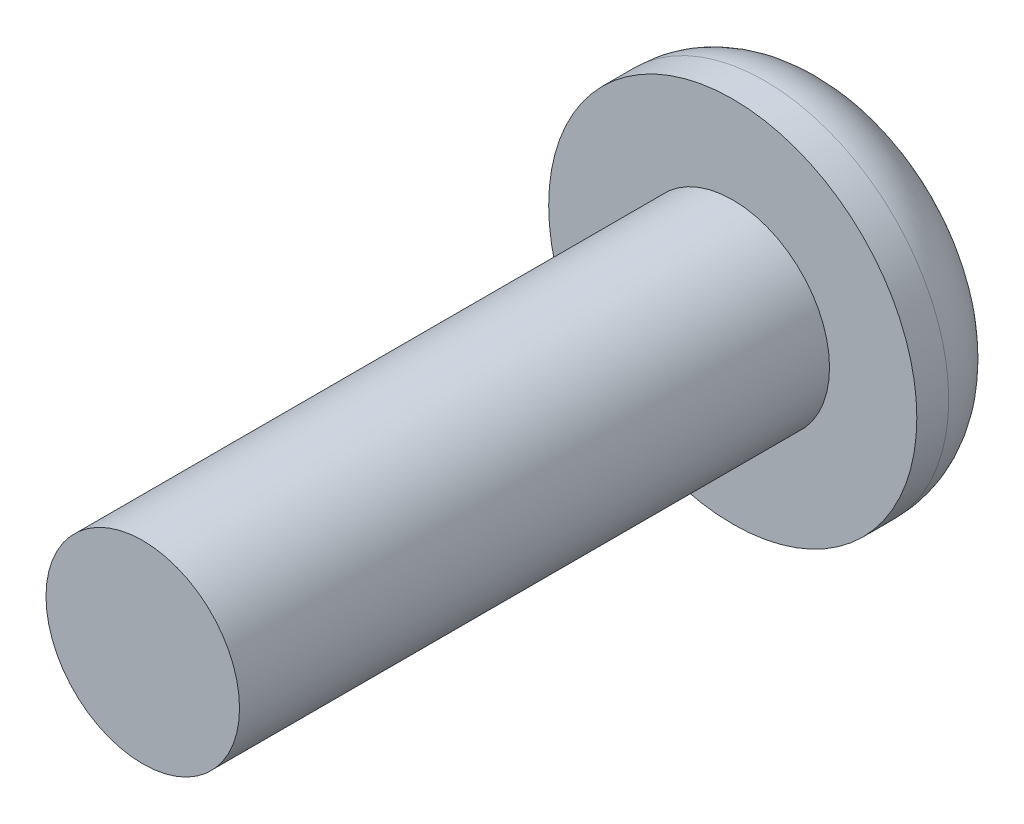
ISO-10303-21;
HEADER;
FILE_DESCRIPTION(('STEP AP214'),'2;1');
FILE_NAME('part.step','',(''),(''),'','','');
FILE_SCHEMA(('AUTOMOTIVE_DESIGN { 1 0 10303 214 1 1 1 1 }'));
ENDSEC;
DATA;
#1=APPLICATION_CONTEXT('core data for automotive mechanical design processes');
#2=APPLICATION_PROTOCOL_DEFINITION('international standard','automotive_design',2000,#1);
#3=PRODUCT_CONTEXT('',#1,'mechanical');
#4=PRODUCT('Part','Part','',(#3));
#5=PRODUCT_RELATED_PRODUCT_CATEGORY('part','',(#4));
#6=PRODUCT_DEFINITION_FORMATION('','',#4);
#7=PRODUCT_DEFINITION_CONTEXT('part definition',#1,'design');
#8=PRODUCT_DEFINITION('design','',#6,#7);
#9=PRODUCT_DEFINITION_SHAPE('','',#8);
#10=(LENGTH_UNIT() NAMED_UNIT(*) SI_UNIT(.MILLI.,.METRE.));
#11=(NAMED_UNIT(*) PLANE_ANGLE_UNIT() SI_UNIT($,.RADIAN.));
#12=(NAMED_UNIT(*) SI_UNIT($,.STERADIAN.) SOLID_ANGLE_UNIT());
#13=UNCERTAINTY_MEASURE_WITH_UNIT(LENGTH_MEASURE(1.E-05),#10,'distance_accuracy_value','');
#14=(GEOMETRIC_REPRESENTATION_CONTEXT(3) GLOBAL_UNCERTAINTY_ASSIGNED_CONTEXT((#13)) GLOBAL_UNIT_ASSIGNED_CONTEXT((#10,
#11,#12)) REPRESENTATION_CONTEXT('',''));
#15=CARTESIAN_POINT('',(0.,0.,0.));
#16=DIRECTION('',(0.,0.,1.));
#17=DIRECTION('',(1.,0.,0.));
#18=AXIS2_PLACEMENT_3D('',#15,#16,#17);
#19=CARTESIAN_POINT('',(0.,0.,2.2098));
#20=DIRECTION('',(0.,0.,1.));
#21=DIRECTION('',(1.,0.,0.));
#22=AXIS2_PLACEMENT_3D('',#19,#20,#21);
#23=PLANE('',#22);
#24=CARTESIAN_POINT('',(0.,0.,2.2098));
#25=DIRECTION('',(0.,0.,1.));
#26=DIRECTION('',(1.,0.,0.));
#27=AXIS2_PLACEMENT_3D('',#24,#25,#26);
#28=CIRCLE('',#27,3.9624);
#29=CARTESIAN_POINT('',(3.9624,0.,2.2098));
#30=VERTEX_POINT('',#29);
#31=EDGE_CURVE('E142',#30,#30,#28,.T.);
#32=ORIENTED_EDGE('',*,*,#31,.T.);
#33=EDGE_LOOP('',(#32));
#34=FACE_BOUND('',#33,.T.);
#35=CARTESIAN_POINT('',(0.,0.,2.2098));
#36=DIRECTION('',(0.,0.,1.));
#37=DIRECTION('',(1.,0.,0.));
#38=AXIS2_PLACEMENT_3D('',#35,#36,#37);
#39=CIRCLE('',#38,2.0828);
#40=CARTESIAN_POINT('',(2.0828,0.,2.2098));
#41=VERTEX_POINT('',#40);
#42=EDGE_CURVE('E133',#41,#41,#39,.T.);
#43=ORIENTED_EDGE('',*,*,#42,.F.);
#44=EDGE_LOOP('',(#43));
#45=FACE_BOUND('',#44,.T.);
#46=ADVANCED_FACE('F31',(#34,#45),#23,.T.);
#47=CARTESIAN_POINT('',(0.,0.,2.2098));
#48=DIRECTION('',(0.,0.,-1.));
#49=DIRECTION('',(-1.,0.,0.));
#50=AXIS2_PLACEMENT_3D('',#47,#48,#49);
#51=CYLINDRICAL_SURFACE('',#50,3.9624);
#52=CARTESIAN_POINT('',(0.,0.,1.524));
#53=DIRECTION('',(0.,0.,1.));
#54=DIRECTION('',(1.,0.,0.));
#55=AXIS2_PLACEMENT_3D('',#52,#53,#54);
#56=CIRCLE('',#55,3.9624);
#57=CARTESIAN_POINT('',(3.9624,0.,1.524));
#58=VERTEX_POINT('',#57);
#59=EDGE_CURVE('E39',#58,#58,#56,.T.);
#60=ORIENTED_EDGE('',*,*,#59,.T.);
#61=EDGE_LOOP('',(#60));
#62=FACE_BOUND('',#61,.T.);
#63=ORIENTED_EDGE('',*,*,#31,.F.);
#64=EDGE_LOOP('',(#63));
#65=FACE_BOUND('',#64,.T.);
#66=ADVANCED_FACE('F149',(#62,#65),#51,.T.);
#67=CARTESIAN_POINT('',(0.,0.,0.));
#68=DIRECTION('',(0.,0.,1.));
#69=DIRECTION('',(1.,0.,0.));
#70=AXIS2_PLACEMENT_3D('',#67,#68,#69);
#71=PLANE('',#70);
#72=DIRECTION('',(0.999833415798117,0.0182521410653723,0.));
#73=VECTOR('',#72,1.);
#74=CARTESIAN_POINT('',(-0.709024608452739,1.17787999902725,0.));
#75=LINE('',#74,#73);
#76=CARTESIAN_POINT('',(-0.709024608452739,1.17787999902725,0.));
#77=VERTEX_POINT('',#76);
#78=CARTESIAN_POINT('',(0.665561697540821,1.20297332234201,0.));
#79=VERTEX_POINT('',#78);
#80=EDGE_CURVE('E120',#77,#79,#75,.T.);
#81=ORIENTED_EDGE('',*,*,#80,.F.);
#82=DIRECTION('',(0.484109890062989,0.875007208166425,0.));
#83=VECTOR('',#82,1.);
#84=CARTESIAN_POINT('',(-1.37458630599356,-0.0250933233147607,0.));
#85=LINE('',#84,#83);
#86=CARTESIAN_POINT('',(-1.37458630599356,-0.0250933233147607,0.));
#87=VERTEX_POINT('',#86);
#88=EDGE_CURVE('E46',#87,#77,#85,.T.);
#89=ORIENTED_EDGE('',*,*,#88,.F.);
#90=DIRECTION('',(-0.515723525735128,0.856755067101052,0.));
#91=VECTOR('',#90,1.);
#92=CARTESIAN_POINT('',(-0.665561697540821,-1.20297332234201,0.));
#93=LINE('',#92,#91);
#94=CARTESIAN_POINT('',(-0.665561697540821,-1.20297332234201,0.));
#95=VERTEX_POINT('',#94);
#96=EDGE_CURVE('E129',#95,#87,#93,.T.);
#97=ORIENTED_EDGE('',*,*,#96,.F.);
#98=DIRECTION('',(-0.999833415798117,-0.0182521410653725,0.));
#99=VECTOR('',#98,1.);
#100=CARTESIAN_POINT('',(0.709024608452739,-1.17787999902725,0.));
#101=LINE('',#100,#99);
#102=CARTESIAN_POINT('',(0.709024608452739,-1.17787999902725,0.));
#103=VERTEX_POINT('',#102);
#104=EDGE_CURVE('E127',#103,#95,#101,.T.);
#105=ORIENTED_EDGE('',*,*,#104,.F.);
#106=DIRECTION('',(-0.484109890062989,-0.875007208166425,0.));
#107=VECTOR('',#106,1.);
#108=CARTESIAN_POINT('',(1.37458630599356,0.0250933233147602,0.));
#109=LINE('',#108,#107);
#110=CARTESIAN_POINT('',(1.37458630599356,0.0250933233147602,0.));
#111=VERTEX_POINT('',#110);
#112=EDGE_CURVE('E94',#111,#103,#109,.T.);
#113=ORIENTED_EDGE('',*,*,#112,.F.);
#114=DIRECTION('',(0.515723525735128,-0.856755067101053,0.));
#115=VECTOR('',#114,1.);
#116=CARTESIAN_POINT('',(0.665561697540821,1.20297332234201,0.));
#117=LINE('',#116,#115);
#118=EDGE_CURVE('E123',#79,#111,#117,.T.);
#119=ORIENTED_EDGE('',*,*,#118,.F.);
#120=EDGE_LOOP('',(#81,#89,#97,#105,#113,#119));
#121=FACE_BOUND('',#120,.T.);
#122=CARTESIAN_POINT('',(0.,0.,0.));
#123=DIRECTION('',(0.,0.,1.));
#124=DIRECTION('',(1.,0.,0.));
#125=AXIS2_PLACEMENT_3D('',#122,#123,#124);
#126=CIRCLE('',#125,2.4384);
#127=CARTESIAN_POINT('',(2.4384,0.,0.));
#128=VERTEX_POINT('',#127);
#129=EDGE_CURVE('E11',#128,#128,#126,.F.);
#130=ORIENTED_EDGE('',*,*,#129,.T.);
#131=EDGE_LOOP('',(#130));
#132=FACE_BOUND('',#131,.T.);
#133=ADVANCED_FACE('F154',(#121,#132),#71,.F.);
#134=CARTESIAN_POINT('',(0.,0.,1.524));
#135=DIRECTION('',(0.,0.,1.));
#136=DIRECTION('',(1.,0.,0.));
#137=AXIS2_PLACEMENT_3D('',#134,#135,#136);
#138=TOROIDAL_SURFACE('',#137,2.4384,1.524);
#139=ORIENTED_EDGE('',*,*,#129,.F.);
#140=EDGE_LOOP('',(#139));
#141=FACE_BOUND('',#140,.T.);
#142=ORIENTED_EDGE('',*,*,#59,.F.);
#143=EDGE_LOOP('',(#142));
#144=FACE_BOUND('',#143,.T.);
#145=ADVANCED_FACE('F33',(#141,#144),#138,.T.);
#146=CARTESIAN_POINT('',(0.,0.,14.9098));
#147=DIRECTION('',(0.,0.,-1.));
#148=DIRECTION('',(-1.,0.,0.));
#149=AXIS2_PLACEMENT_3D('',#146,#147,#148);
#150=CYLINDRICAL_SURFACE('',#149,2.0828);
#151=CARTESIAN_POINT('',(0.,0.,14.9098));
#152=DIRECTION('',(0.,0.,1.));
#153=DIRECTION('',(1.,0.,0.));
#154=AXIS2_PLACEMENT_3D('',#151,#152,#153);
#155=CIRCLE('',#154,2.0828);
#156=CARTESIAN_POINT('',(2.0828,0.,14.9098));
#157=VERTEX_POINT('',#156);
#158=EDGE_CURVE('E139',#157,#157,#155,.T.);
#159=ORIENTED_EDGE('',*,*,#158,.F.);
#160=EDGE_LOOP('',(#159));
#161=FACE_BOUND('',#160,.T.);
#162=ORIENTED_EDGE('',*,*,#42,.T.);
#163=EDGE_LOOP('',(#162));
#164=FACE_BOUND('',#163,.T.);
#165=ADVANCED_FACE('F153',(#161,#164),#150,.T.);
#166=CARTESIAN_POINT('',(0.,0.,14.9098));
#167=DIRECTION('',(0.,0.,1.));
#168=DIRECTION('',(1.,0.,0.));
#169=AXIS2_PLACEMENT_3D('',#166,#167,#168);
#170=PLANE('',#169);
#171=ORIENTED_EDGE('',*,*,#158,.T.);
#172=EDGE_LOOP('',(#171));
#173=FACE_BOUND('',#172,.T.);
#174=ADVANCED_FACE('F160',(#173),#170,.T.);
#175=CARTESIAN_POINT('',(-1.37458630599356,-0.0250933233147607,1.016));
#176=DIRECTION('',(-0.875007208166425,0.484109890062989,0.));
#177=DIRECTION('',(-0.484109890062989,-0.875007208166425,0.));
#178=AXIS2_PLACEMENT_3D('',#175,#176,#177);
#179=PLANE('',#178);
#180=ORIENTED_EDGE('',*,*,#88,.T.);
#181=DIRECTION('',(0.,0.,-1.));
#182=VECTOR('',#181,1.);
#183=CARTESIAN_POINT('',(-0.709024608452739,1.17787999902725,1.016));
#184=LINE('',#183,#182);
#185=CARTESIAN_POINT('',(-0.709024608452739,1.17787999902725,1.016));
#186=VERTEX_POINT('',#185);
#187=EDGE_CURVE('E76',#186,#77,#184,.T.);
#188=ORIENTED_EDGE('',*,*,#187,.F.);
#189=DIRECTION('',(0.484109890062989,0.875007208166425,0.));
#190=VECTOR('',#189,1.);
#191=CARTESIAN_POINT('',(-1.37458630599356,-0.0250933233147607,1.016));
#192=LINE('',#191,#190);
#193=CARTESIAN_POINT('',(-1.37458630599356,-0.0250933233147607,1.016));
#194=VERTEX_POINT('',#193);
#195=EDGE_CURVE('E131',#194,#186,#192,.T.);
#196=ORIENTED_EDGE('',*,*,#195,.F.);
#197=DIRECTION('',(0.,0.,-1.));
#198=VECTOR('',#197,1.);
#199=CARTESIAN_POINT('',(-1.37458630599356,-0.0250933233147607,1.016));
#200=LINE('',#199,#198);
#201=EDGE_CURVE('E54',#194,#87,#200,.T.);
#202=ORIENTED_EDGE('',*,*,#201,.T.);
#203=EDGE_LOOP('',(#180,#188,#196,#202));
#204=FACE_BOUND('',#203,.T.);
#205=ADVANCED_FACE('F176',(#204),#179,.F.);
#206=CARTESIAN_POINT('',(-0.665561697540821,-1.20297332234201,1.016));
#207=DIRECTION('',(-0.856755067101052,-0.515723525735128,0.));
#208=DIRECTION('',(0.515723525735128,-0.856755067101052,0.));
#209=AXIS2_PLACEMENT_3D('',#206,#207,#208);
#210=PLANE('',#209);
#211=ORIENTED_EDGE('',*,*,#96,.T.);
#212=ORIENTED_EDGE('',*,*,#201,.F.);
#213=DIRECTION('',(-0.515723525735128,0.856755067101052,0.));
#214=VECTOR('',#213,1.);
#215=CARTESIAN_POINT('',(-0.665561697540821,-1.20297332234201,1.016));
#216=LINE('',#215,#214);
#217=CARTESIAN_POINT('',(-0.665561697540821,-1.20297332234201,1.016));
#218=VERTEX_POINT('',#217);
#219=EDGE_CURVE('E106',#218,#194,#216,.T.);
#220=ORIENTED_EDGE('',*,*,#219,.F.);
#221=DIRECTION('',(0.,0.,-1.));
#222=VECTOR('',#221,1.);
#223=CARTESIAN_POINT('',(-0.665561697540821,-1.20297332234201,1.016));
#224=LINE('',#223,#222);
#225=EDGE_CURVE('E98',#218,#95,#224,.T.);
#226=ORIENTED_EDGE('',*,*,#225,.T.);
#227=EDGE_LOOP('',(#211,#212,#220,#226));
#228=FACE_BOUND('',#227,.T.);
#229=ADVANCED_FACE('F180',(#228),#210,.F.);
#230=CARTESIAN_POINT('',(0.709024608452739,-1.17787999902725,1.016));
#231=DIRECTION('',(0.0182521410653725,-0.999833415798117,0.));
#232=DIRECTION('',(0.999833415798117,0.0182521410653725,0.));
#233=AXIS2_PLACEMENT_3D('',#230,#231,#232);
#234=PLANE('',#233);
#235=ORIENTED_EDGE('',*,*,#104,.T.);
#236=ORIENTED_EDGE('',*,*,#225,.F.);
#237=DIRECTION('',(-0.999833415798117,-0.0182521410653725,0.));
#238=VECTOR('',#237,1.);
#239=CARTESIAN_POINT('',(0.709024608452739,-1.17787999902725,1.016));
#240=LINE('',#239,#238);
#241=CARTESIAN_POINT('',(0.709024608452739,-1.17787999902725,1.016));
#242=VERTEX_POINT('',#241);
#243=EDGE_CURVE('E102',#242,#218,#240,.T.);
#244=ORIENTED_EDGE('',*,*,#243,.F.);
#245=DIRECTION('',(0.,0.,-1.));
#246=VECTOR('',#245,1.);
#247=CARTESIAN_POINT('',(0.709024608452739,-1.17787999902725,1.016));
#248=LINE('',#247,#246);
#249=EDGE_CURVE('E87',#242,#103,#248,.T.);
#250=ORIENTED_EDGE('',*,*,#249,.T.);
#251=EDGE_LOOP('',(#235,#236,#244,#250));
#252=FACE_BOUND('',#251,.T.);
#253=ADVANCED_FACE('F103',(#252),#234,.F.);
#254=CARTESIAN_POINT('',(1.37458630599356,0.0250933233147602,1.016));
#255=DIRECTION('',(0.875007208166425,-0.484109890062989,0.));
#256=DIRECTION('',(0.484109890062989,0.875007208166425,0.));
#257=AXIS2_PLACEMENT_3D('',#254,#255,#256);
#258=PLANE('',#257);
#259=ORIENTED_EDGE('',*,*,#112,.T.);
#260=ORIENTED_EDGE('',*,*,#249,.F.);
#261=DIRECTION('',(-0.484109890062989,-0.875007208166425,0.));
#262=VECTOR('',#261,1.);
#263=CARTESIAN_POINT('',(1.37458630599356,0.0250933233147602,1.016));
#264=LINE('',#263,#262);
#265=CARTESIAN_POINT('',(1.37458630599356,0.0250933233147602,1.016));
#266=VERTEX_POINT('',#265);
#267=EDGE_CURVE('E91',#266,#242,#264,.T.);
#268=ORIENTED_EDGE('',*,*,#267,.F.);
#269=DIRECTION('',(0.,0.,-1.));
#270=VECTOR('',#269,1.);
#271=CARTESIAN_POINT('',(1.37458630599356,0.0250933233147602,1.016));
#272=LINE('',#271,#270);
#273=EDGE_CURVE('E99',#266,#111,#272,.T.);
#274=ORIENTED_EDGE('',*,*,#273,.T.);
#275=EDGE_LOOP('',(#259,#260,#268,#274));
#276=FACE_BOUND('',#275,.T.);
#277=ADVANCED_FACE('F89',(#276),#258,.F.);
#278=CARTESIAN_POINT('',(0.665561697540821,1.20297332234201,1.016));
#279=DIRECTION('',(0.856755067101053,0.515723525735128,0.));
#280=DIRECTION('',(-0.515723525735128,0.856755067101053,0.));
#281=AXIS2_PLACEMENT_3D('',#278,#279,#280);
#282=PLANE('',#281);
#283=ORIENTED_EDGE('',*,*,#118,.T.);
#284=ORIENTED_EDGE('',*,*,#273,.F.);
#285=DIRECTION('',(0.515723525735128,-0.856755067101053,0.));
#286=VECTOR('',#285,1.);
#287=CARTESIAN_POINT('',(0.665561697540821,1.20297332234201,1.016));
#288=LINE('',#287,#286);
#289=CARTESIAN_POINT('',(0.665561697540821,1.20297332234201,1.016));
#290=VERTEX_POINT('',#289);
#291=EDGE_CURVE('E112',#290,#266,#288,.T.);
#292=ORIENTED_EDGE('',*,*,#291,.F.);
#293=DIRECTION('',(0.,0.,-1.));
#294=VECTOR('',#293,1.);
#295=CARTESIAN_POINT('',(0.665561697540821,1.20297332234201,1.016));
#296=LINE('',#295,#294);
#297=EDGE_CURVE('E136',#290,#79,#296,.T.);
#298=ORIENTED_EDGE('',*,*,#297,.T.);
#299=EDGE_LOOP('',(#283,#284,#292,#298));
#300=FACE_BOUND('',#299,.T.);
#301=ADVANCED_FACE('F184',(#300),#282,.F.);
#302=CARTESIAN_POINT('',(-0.709024608452739,1.17787999902725,1.016));
#303=DIRECTION('',(-0.0182521410653723,0.999833415798117,0.));
#304=DIRECTION('',(-0.999833415798117,-0.0182521410653723,0.));
#305=AXIS2_PLACEMENT_3D('',#302,#303,#304);
#306=PLANE('',#305);
#307=ORIENTED_EDGE('',*,*,#80,.T.);
#308=ORIENTED_EDGE('',*,*,#297,.F.);
#309=DIRECTION('',(0.999833415798117,0.0182521410653723,0.));
#310=VECTOR('',#309,1.);
#311=CARTESIAN_POINT('',(-0.709024608452739,1.17787999902725,1.016));
#312=LINE('',#311,#310);
#313=EDGE_CURVE('E114',#186,#290,#312,.T.);
#314=ORIENTED_EDGE('',*,*,#313,.F.);
#315=ORIENTED_EDGE('',*,*,#187,.T.);
#316=EDGE_LOOP('',(#307,#308,#314,#315));
#317=FACE_BOUND('',#316,.T.);
#318=ADVANCED_FACE('F181',(#317),#306,.F.);
#319=CARTESIAN_POINT('',(-0.709024608452739,1.17787999902725,1.016));
#320=DIRECTION('',(0.,0.,-1.));
#321=DIRECTION('',(-1.,0.,0.));
#322=AXIS2_PLACEMENT_3D('',#319,#320,#321);
#323=PLANE('',#322);
#324=ORIENTED_EDGE('',*,*,#195,.T.);
#325=ORIENTED_EDGE('',*,*,#313,.T.);
#326=ORIENTED_EDGE('',*,*,#291,.T.);
#327=ORIENTED_EDGE('',*,*,#267,.T.);
#328=ORIENTED_EDGE('',*,*,#243,.T.);
#329=ORIENTED_EDGE('',*,*,#219,.T.);
#330=EDGE_LOOP('',(#324,#325,#326,#327,#328,#329));
#331=FACE_BOUND('',#330,.T.);
#332=ADVANCED_FACE('F109',(#331),#323,.T.);
#333=CLOSED_SHELL('',(#46,#66,#133,#145,#165,#174,#205,#229,#253,#277,#301,#318,#332));
#334=MANIFOLD_SOLID_BREP('B2',#333);
#335=ADVANCED_BREP_SHAPE_REPRESENTATION('',(#18,#334),#14);
#336=SHAPE_DEFINITION_REPRESENTATION(#9,#335);
ENDSEC;
END-ISO-10303-21;
